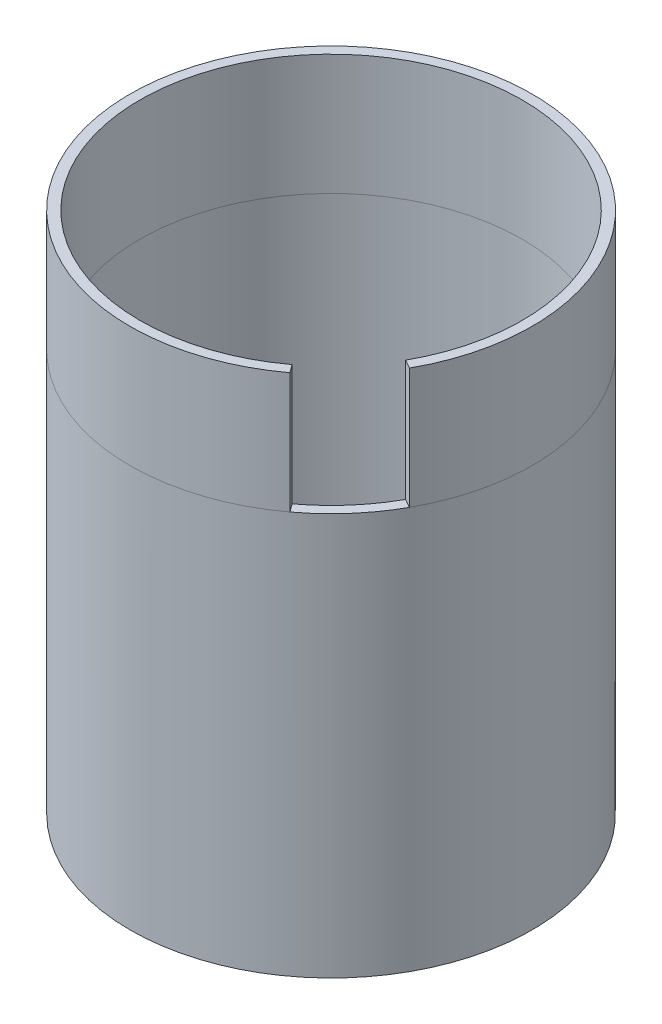
ISO-10303-21;
HEADER;
FILE_DESCRIPTION(('STEP AP214'),'2;1');
FILE_NAME('part.step','',(''),(''),'','','');
FILE_SCHEMA(('AUTOMOTIVE_DESIGN { 1 0 10303 214 1 1 1 1 }'));
ENDSEC;
DATA;
#1=APPLICATION_CONTEXT('core data for automotive mechanical design processes');
#2=APPLICATION_PROTOCOL_DEFINITION('international standard','automotive_design',2000,#1);
#3=PRODUCT_CONTEXT('',#1,'mechanical');
#4=PRODUCT('Part','Part','',(#3));
#5=PRODUCT_RELATED_PRODUCT_CATEGORY('part','',(#4));
#6=PRODUCT_DEFINITION_FORMATION('','',#4);
#7=PRODUCT_DEFINITION_CONTEXT('part definition',#1,'design');
#8=PRODUCT_DEFINITION('design','',#6,#7);
#9=PRODUCT_DEFINITION_SHAPE('','',#8);
#10=(LENGTH_UNIT() NAMED_UNIT(*) SI_UNIT(.MILLI.,.METRE.));
#11=(NAMED_UNIT(*) PLANE_ANGLE_UNIT() SI_UNIT($,.RADIAN.));
#12=(NAMED_UNIT(*) SI_UNIT($,.STERADIAN.) SOLID_ANGLE_UNIT());
#13=UNCERTAINTY_MEASURE_WITH_UNIT(LENGTH_MEASURE(1.E-05),#10,'distance_accuracy_value','');
#14=(GEOMETRIC_REPRESENTATION_CONTEXT(3) GLOBAL_UNCERTAINTY_ASSIGNED_CONTEXT((#13)) GLOBAL_UNIT_ASSIGNED_CONTEXT((#10,
#11,#12)) REPRESENTATION_CONTEXT('',''));
#15=CARTESIAN_POINT('',(0.,0.,0.));
#16=DIRECTION('',(0.,0.,1.));
#17=DIRECTION('',(1.,0.,0.));
#18=AXIS2_PLACEMENT_3D('',#15,#16,#17);
#19=CARTESIAN_POINT('',(0.,10.,0.));
#20=DIRECTION('',(0.,1.,0.));
#21=DIRECTION('',(0.,0.,1.));
#22=AXIS2_PLACEMENT_3D('',#19,#20,#21);
#23=PLANE('',#22);
#24=DIRECTION('',(-0.597606031945077,0.,-0.801789891793891));
#25=VECTOR('',#24,1.);
#26=CARTESIAN_POINT('',(2.83823440426627,10.,3.80879580267035));
#27=LINE('',#26,#25);
#28=CARTESIAN_POINT('',(2.98787427769276,10.,4.00956234774138));
#29=VERTEX_POINT('',#28);
#30=CARTESIAN_POINT('',(2.83847167397945,10.,3.80911348809926));
#31=VERTEX_POINT('',#30);
#32=EDGE_CURVE('E97',#29,#31,#27,.T.);
#33=ORIENTED_EDGE('',*,*,#32,.F.);
#34=CARTESIAN_POINT('',(2.98811225857689,10.,4.00988170495106));
#35=CARTESIAN_POINT('',(3.05874961412,10.,3.95714496684354));
#36=CARTESIAN_POINT('',(3.12795811513627,10.,3.90249971083015));
#37=CARTESIAN_POINT('',(3.26378625637533,10.,3.78929476409096));
#38=CARTESIAN_POINT('',(3.33038835339411,10.,3.73071401523426));
#39=CARTESIAN_POINT('',(3.44296958884833,10.,3.62635939645509));
#40=CARTESIAN_POINT('',(3.48968159047516,10.,3.58137367620945));
#41=CARTESIAN_POINT('',(3.55284931685749,10.,3.51822323249965));
#42=CARTESIAN_POINT('',(3.57004212989055,10.,3.50079076493173));
#43=CARTESIAN_POINT('',(3.64905802892788,10.,3.41951973556877));
#44=CARTESIAN_POINT('',(3.70936279027402,10.,3.35418703662105));
#45=CARTESIAN_POINT('',(3.82602442604878,10.,3.22086144498683));
#46=CARTESIAN_POINT('',(3.88240493239272,10.,3.15288918260485));
#47=CARTESIAN_POINT('',(3.99123279762959,10.,3.0142882877372));
#48=CARTESIAN_POINT('',(4.04369456841923,10.,2.94367098530316));
#49=CARTESIAN_POINT('',(4.14469026771082,10.,2.79978966670378));
#50=CARTESIAN_POINT('',(4.1932281548717,10.,2.7265284286538));
#51=CARTESIAN_POINT('',(4.28639735277926,10.,2.57737268242569));
#52=CARTESIAN_POINT('',(4.33102122016573,10.,2.50147352450257));
#53=CARTESIAN_POINT('',(4.37357819670501,10.,2.42443316822768));
#54=B_SPLINE_CURVE_WITH_KNOTS('',3,(#34,#35,#36,#37,#38,#39,#40,#41,#42,#43,#44,#45,#46,#47,#48,
#49,#50,#51,#52,#53),.UNSPECIFIED.,.F.,.F.,(4,2,2,2,2,2,2,2,2,4),(0.,0.264421089441013,
0.530391366624525,0.724897621749499,0.798349871680888,1.06494139858212,1.32975625230522,
1.59354361990392,1.85706145207539,2.12107002098075),.UNSPECIFIED.);
#55=CARTESIAN_POINT('',(4.37331309980586,10.,2.42428621539267));
#56=VERTEX_POINT('',#55);
#57=EDGE_CURVE('E11',#29,#56,#54,.T.);
#58=ORIENTED_EDGE('',*,*,#57,.T.);
#59=DIRECTION('',(0.874561884751915,0.,0.484913919927215));
#60=VECTOR('',#59,1.);
#61=CARTESIAN_POINT('',(4.1544073577574,10.,2.30291109377048));
#62=LINE('',#61,#60);
#63=CARTESIAN_POINT('',(4.1546818374366,10.,2.30306285362824));
#64=VERTEX_POINT('',#63);
#65=EDGE_CURVE('E53',#64,#56,#62,.T.);
#66=ORIENTED_EDGE('',*,*,#65,.F.);
#67=CARTESIAN_POINT('',(0.,10.,0.));
#68=DIRECTION('',(0.,1.,0.));
#69=DIRECTION('',(0.59752304633226,0.,0.801851737606034));
#70=AXIS2_PLACEMENT_3D('',#67,#68,#69);
#71=CIRCLE('',#70,4.75);
#72=EDGE_CURVE('E104',#31,#64,#71,.T.);
#73=ORIENTED_EDGE('',*,*,#72,.F.);
#74=EDGE_LOOP('',(#33,#58,#66,#73));
#75=FACE_BOUND('',#74,.T.);
#76=ADVANCED_FACE('F36',(#75),#23,.T.);
#77=CARTESIAN_POINT('',(0.,0.,0.));
#78=DIRECTION('',(0.,1.,0.));
#79=DIRECTION('',(0.,0.,1.));
#80=AXIS2_PLACEMENT_3D('',#77,#78,#79);
#81=PLANE('',#80);
#82=CARTESIAN_POINT('',(0.,0.,0.));
#83=DIRECTION('',(0.,1.,0.));
#84=DIRECTION('',(0.,0.,1.));
#85=AXIS2_PLACEMENT_3D('',#82,#83,#84);
#86=CIRCLE('',#85,5.);
#87=CARTESIAN_POINT('',(0.,0.,5.));
#88=VERTEX_POINT('',#87);
#89=EDGE_CURVE('E47',#88,#88,#86,.T.);
#90=ORIENTED_EDGE('',*,*,#89,.F.);
#91=EDGE_LOOP('',(#90));
#92=FACE_BOUND('',#91,.T.);
#93=CARTESIAN_POINT('',(0.,0.,0.));
#94=DIRECTION('',(0.,1.,0.));
#95=DIRECTION('',(0.,0.,1.));
#96=AXIS2_PLACEMENT_3D('',#93,#94,#95);
#97=CIRCLE('',#96,4.75);
#98=CARTESIAN_POINT('',(0.,0.,4.75));
#99=VERTEX_POINT('',#98);
#100=EDGE_CURVE('E101',#99,#99,#97,.T.);
#101=ORIENTED_EDGE('',*,*,#100,.T.);
#102=EDGE_LOOP('',(#101));
#103=FACE_BOUND('',#102,.T.);
#104=ADVANCED_FACE('F132',(#92,#103),#81,.F.);
#105=CARTESIAN_POINT('',(0.,10.,0.));
#106=DIRECTION('',(0.,-1.,0.));
#107=DIRECTION('',(0.,0.,-1.));
#108=AXIS2_PLACEMENT_3D('',#105,#106,#107);
#109=CYLINDRICAL_SURFACE('',#108,5.);
#110=ORIENTED_EDGE('',*,*,#57,.F.);
#111=CARTESIAN_POINT('',(-0.00175936411914237,10.,-0.00153771896034336));
#112=DIRECTION('',(0.,1.,0.));
#113=DIRECTION('',(0.874561884751917,0.,0.484913919927212));
#114=AXIS2_PLACEMENT_3D('',#111,#112,#113);
#115=CIRCLE('',#114,5.00228430995288);
#116=EDGE_CURVE('E148',#56,#29,#115,.T.);
#117=ORIENTED_EDGE('',*,*,#116,.F.);
#118=EDGE_LOOP('',(#110,#117));
#119=FACE_BOUND('',#118,.T.);
#120=ORIENTED_EDGE('',*,*,#89,.T.);
#121=EDGE_LOOP('',(#120));
#122=FACE_BOUND('',#121,.T.);
#123=ADVANCED_FACE('F38',(#119,#122),#109,.T.);
#124=CARTESIAN_POINT('',(0.,10.,0.));
#125=DIRECTION('',(0.,-1.,0.));
#126=DIRECTION('',(0.,0.,-1.));
#127=AXIS2_PLACEMENT_3D('',#124,#125,#126);
#128=CYLINDRICAL_SURFACE('',#127,4.75);
#129=ORIENTED_EDGE('',*,*,#72,.T.);
#130=CARTESIAN_POINT('',(-0.00175936411914237,10.,-0.00153771896034336));
#131=DIRECTION('',(0.,-1.,0.));
#132=DIRECTION('',(0.597606031945083,0.,0.801789891793887));
#133=AXIS2_PLACEMENT_3D('',#130,#131,#132);
#134=CIRCLE('',#133,4.75228430868046);
#135=EDGE_CURVE('E58',#31,#64,#134,.T.);
#136=ORIENTED_EDGE('',*,*,#135,.F.);
#137=EDGE_LOOP('',(#129,#136));
#138=FACE_BOUND('',#137,.T.);
#139=ORIENTED_EDGE('',*,*,#100,.F.);
#140=EDGE_LOOP('',(#139));
#141=FACE_BOUND('',#140,.T.);
#142=ADVANCED_FACE('F133',(#138,#141),#128,.F.);
#143=CARTESIAN_POINT('',(-0.00175936411914237,13.,-0.00153771896034336));
#144=DIRECTION('',(0.,-1.,0.));
#145=DIRECTION('',(0.,0.,-1.));
#146=AXIS2_PLACEMENT_3D('',#143,#144,#145);
#147=CYLINDRICAL_SURFACE('',#146,4.75228430868046);
#148=ORIENTED_EDGE('',*,*,#135,.T.);
#149=DIRECTION('',(0.,-1.,0.));
#150=VECTOR('',#149,1.);
#151=CARTESIAN_POINT('',(4.1544073577574,13.,2.30291109377048));
#152=LINE('',#151,#150);
#153=CARTESIAN_POINT('',(4.1544073577574,13.,2.30291109377048));
#154=VERTEX_POINT('',#153);
#155=EDGE_CURVE('E82',#154,#64,#152,.T.);
#156=ORIENTED_EDGE('',*,*,#155,.F.);
#157=CARTESIAN_POINT('',(-0.00175936411914237,13.,-0.00153771896034336));
#158=DIRECTION('',(0.,-1.,0.));
#159=DIRECTION('',(0.,0.,-1.));
#160=AXIS2_PLACEMENT_3D('',#157,#158,#159);
#161=CIRCLE('',#160,4.75228430868046);
#162=CARTESIAN_POINT('',(2.83823440426627,13.,3.80879580267035));
#163=VERTEX_POINT('',#162);
#164=EDGE_CURVE('E88',#163,#154,#161,.T.);
#165=ORIENTED_EDGE('',*,*,#164,.F.);
#166=DIRECTION('',(0.,-1.,0.));
#167=VECTOR('',#166,1.);
#168=CARTESIAN_POINT('',(2.83823440426627,13.,3.80879580267035));
#169=LINE('',#168,#167);
#170=EDGE_CURVE('E171',#163,#31,#169,.T.);
#171=ORIENTED_EDGE('',*,*,#170,.T.);
#172=EDGE_LOOP('',(#148,#156,#165,#171));
#173=FACE_BOUND('',#172,.T.);
#174=ADVANCED_FACE('F99',(#173),#147,.F.);
#175=CARTESIAN_POINT('',(4.1544073577574,13.,2.30291109377048));
#176=DIRECTION('',(0.484913919927215,0.,-0.874561884751915));
#177=DIRECTION('',(-0.874561884751915,0.,-0.484913919927215));
#178=AXIS2_PLACEMENT_3D('',#175,#176,#177);
#179=PLANE('',#178);
#180=ORIENTED_EDGE('',*,*,#65,.T.);
#181=DIRECTION('',(0.,-1.,0.));
#182=VECTOR('',#181,1.);
#183=CARTESIAN_POINT('',(4.37304783005819,13.,2.4241395743693));
#184=LINE('',#183,#182);
#185=CARTESIAN_POINT('',(4.37304783005819,13.,2.4241395743693));
#186=VERTEX_POINT('',#185);
#187=EDGE_CURVE('E84',#186,#56,#184,.T.);
#188=ORIENTED_EDGE('',*,*,#187,.F.);
#189=DIRECTION('',(0.874561884751915,0.,0.484913919927215));
#190=VECTOR('',#189,1.);
#191=CARTESIAN_POINT('',(4.1544073577574,13.,2.30291109377048));
#192=LINE('',#191,#190);
#193=EDGE_CURVE('E78',#154,#186,#192,.T.);
#194=ORIENTED_EDGE('',*,*,#193,.F.);
#195=ORIENTED_EDGE('',*,*,#155,.T.);
#196=EDGE_LOOP('',(#180,#188,#194,#195));
#197=FACE_BOUND('',#196,.T.);
#198=ADVANCED_FACE('F80',(#197),#179,.F.);
#199=CARTESIAN_POINT('',(-0.00175936411914237,13.,-0.00153771896034336));
#200=DIRECTION('',(0.,-1.,0.));
#201=DIRECTION('',(0.,0.,-1.));
#202=AXIS2_PLACEMENT_3D('',#199,#200,#201);
#203=CYLINDRICAL_SURFACE('',#202,5.00228430995288);
#204=ORIENTED_EDGE('',*,*,#116,.T.);
#205=DIRECTION('',(0.,-1.,0.));
#206=VECTOR('',#205,1.);
#207=CARTESIAN_POINT('',(2.98763591301295,13.,4.00924327663904));
#208=LINE('',#207,#206);
#209=CARTESIAN_POINT('',(2.98763591301295,13.,4.00924327663904));
#210=VERTEX_POINT('',#209);
#211=EDGE_CURVE('E106',#210,#29,#208,.T.);
#212=ORIENTED_EDGE('',*,*,#211,.F.);
#213=CARTESIAN_POINT('',(-0.00175936411914237,13.,-0.00153771896034336));
#214=DIRECTION('',(0.,1.,0.));
#215=DIRECTION('',(0.,0.,1.));
#216=AXIS2_PLACEMENT_3D('',#213,#214,#215);
#217=CIRCLE('',#216,5.00228430995288);
#218=EDGE_CURVE('E87',#186,#210,#217,.T.);
#219=ORIENTED_EDGE('',*,*,#218,.F.);
#220=ORIENTED_EDGE('',*,*,#187,.T.);
#221=EDGE_LOOP('',(#204,#212,#219,#220));
#222=FACE_BOUND('',#221,.T.);
#223=ADVANCED_FACE('F190',(#222),#203,.T.);
#224=CARTESIAN_POINT('',(2.83823440426627,13.,3.80879580267035));
#225=DIRECTION('',(-0.801789891793891,0.,0.597606031945077));
#226=DIRECTION('',(0.597606031945077,0.,0.801789891793891));
#227=AXIS2_PLACEMENT_3D('',#224,#225,#226);
#228=PLANE('',#227);
#229=ORIENTED_EDGE('',*,*,#32,.T.);
#230=ORIENTED_EDGE('',*,*,#170,.F.);
#231=DIRECTION('',(-0.597606031945077,0.,-0.801789891793891));
#232=VECTOR('',#231,1.);
#233=CARTESIAN_POINT('',(2.83823440426627,13.,3.80879580267035));
#234=LINE('',#233,#232);
#235=EDGE_CURVE('E93',#210,#163,#234,.T.);
#236=ORIENTED_EDGE('',*,*,#235,.F.);
#237=ORIENTED_EDGE('',*,*,#211,.T.);
#238=EDGE_LOOP('',(#229,#230,#236,#237));
#239=FACE_BOUND('',#238,.T.);
#240=ADVANCED_FACE('F170',(#239),#228,.F.);
#241=CARTESIAN_POINT('',(-0.00175936411914237,13.,-0.00153771896034336));
#242=DIRECTION('',(0.,-1.,0.));
#243=DIRECTION('',(0.,0.,-1.));
#244=AXIS2_PLACEMENT_3D('',#241,#242,#243);
#245=PLANE('',#244);
#246=ORIENTED_EDGE('',*,*,#164,.T.);
#247=ORIENTED_EDGE('',*,*,#193,.T.);
#248=ORIENTED_EDGE('',*,*,#218,.T.);
#249=ORIENTED_EDGE('',*,*,#235,.T.);
#250=EDGE_LOOP('',(#246,#247,#248,#249));
#251=FACE_BOUND('',#250,.T.);
#252=ADVANCED_FACE('F91',(#251),#245,.F.);
#253=CLOSED_SHELL('',(#76,#104,#123,#142,#174,#198,#223,#240,#252));
#254=MANIFOLD_SOLID_BREP('B2',#253);
#255=ADVANCED_BREP_SHAPE_REPRESENTATION('',(#18,#254),#14);
#256=SHAPE_DEFINITION_REPRESENTATION(#9,#255);
ENDSEC;
END-ISO-10303-21;
